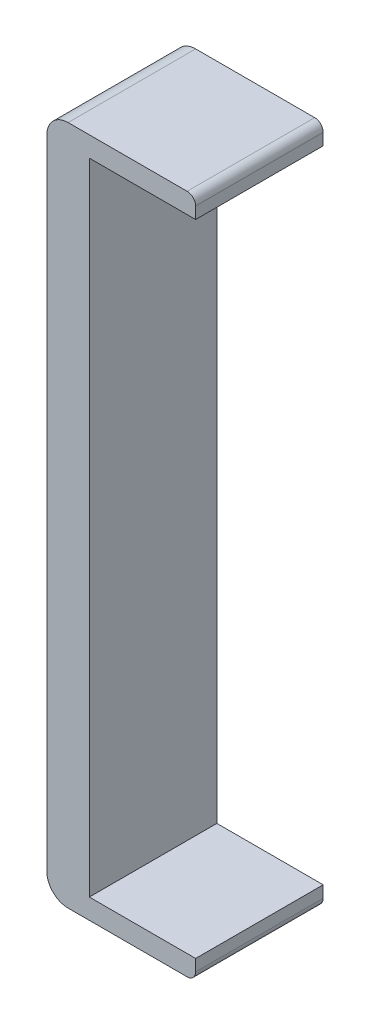
ISO-10303-21;
HEADER;
FILE_DESCRIPTION(('STEP AP214'),'2;1');
FILE_NAME('part.step','',(''),(''),'','','');
FILE_SCHEMA(('AUTOMOTIVE_DESIGN { 1 0 10303 214 1 1 1 1 }'));
ENDSEC;
DATA;
#1=APPLICATION_CONTEXT('core data for automotive mechanical design processes');
#2=APPLICATION_PROTOCOL_DEFINITION('international standard','automotive_design',2000,#1);
#3=PRODUCT_CONTEXT('',#1,'mechanical');
#4=PRODUCT('Part','Part','',(#3));
#5=PRODUCT_RELATED_PRODUCT_CATEGORY('part','',(#4));
#6=PRODUCT_DEFINITION_FORMATION('','',#4);
#7=PRODUCT_DEFINITION_CONTEXT('part definition',#1,'design');
#8=PRODUCT_DEFINITION('design','',#6,#7);
#9=PRODUCT_DEFINITION_SHAPE('','',#8);
#10=(LENGTH_UNIT() NAMED_UNIT(*) SI_UNIT(.MILLI.,.METRE.));
#11=(NAMED_UNIT(*) PLANE_ANGLE_UNIT() SI_UNIT($,.RADIAN.));
#12=(NAMED_UNIT(*) SI_UNIT($,.STERADIAN.) SOLID_ANGLE_UNIT());
#13=UNCERTAINTY_MEASURE_WITH_UNIT(LENGTH_MEASURE(1.E-05),#10,'distance_accuracy_value','');
#14=(GEOMETRIC_REPRESENTATION_CONTEXT(3) GLOBAL_UNCERTAINTY_ASSIGNED_CONTEXT((#13)) GLOBAL_UNIT_ASSIGNED_CONTEXT((#10,
#11,#12)) REPRESENTATION_CONTEXT('',''));
#15=CARTESIAN_POINT('',(0.,0.,0.));
#16=DIRECTION('',(0.,0.,1.));
#17=DIRECTION('',(1.,0.,0.));
#18=AXIS2_PLACEMENT_3D('',#15,#16,#17);
#19=CARTESIAN_POINT('',(-12.5,74.9998503349519,30.));
#20=DIRECTION('',(0.,0.,-1.));
#21=DIRECTION('',(-1.,0.,0.));
#22=AXIS2_PLACEMENT_3D('',#19,#20,#21);
#23=CYLINDRICAL_SURFACE('',#22,5.);
#24=CARTESIAN_POINT('',(-12.5,74.9998503349519,0.));
#25=DIRECTION('',(0.,0.,1.));
#26=DIRECTION('',(1.,0.,0.));
#27=AXIS2_PLACEMENT_3D('',#24,#25,#26);
#28=CIRCLE('',#27,5.);
#29=CARTESIAN_POINT('',(-12.5,79.9998503349519,0.));
#30=VERTEX_POINT('',#29);
#31=CARTESIAN_POINT('',(-17.5,74.9998503349519,0.));
#32=VERTEX_POINT('',#31);
#33=EDGE_CURVE('E153',#30,#32,#28,.T.);
#34=ORIENTED_EDGE('',*,*,#33,.T.);
#35=DIRECTION('',(0.,0.,-1.));
#36=VECTOR('',#35,1.);
#37=CARTESIAN_POINT('',(-17.5,74.9998503349519,30.));
#38=LINE('',#37,#36);
#39=CARTESIAN_POINT('',(-17.5,74.9998503349519,30.));
#40=VERTEX_POINT('',#39);
#41=EDGE_CURVE('E11',#40,#32,#38,.T.);
#42=ORIENTED_EDGE('',*,*,#41,.F.);
#43=CARTESIAN_POINT('',(-12.5,74.9998503349519,30.));
#44=DIRECTION('',(0.,0.,1.));
#45=DIRECTION('',(1.,0.,0.));
#46=AXIS2_PLACEMENT_3D('',#43,#44,#45);
#47=CIRCLE('',#46,5.);
#48=CARTESIAN_POINT('',(-12.5,79.9998503349519,30.));
#49=VERTEX_POINT('',#48);
#50=EDGE_CURVE('E175',#49,#40,#47,.T.);
#51=ORIENTED_EDGE('',*,*,#50,.F.);
#52=DIRECTION('',(0.,0.,-1.));
#53=VECTOR('',#52,1.);
#54=CARTESIAN_POINT('',(-12.5,79.9998503349519,30.));
#55=LINE('',#54,#53);
#56=EDGE_CURVE('E149',#49,#30,#55,.T.);
#57=ORIENTED_EDGE('',*,*,#56,.T.);
#58=EDGE_LOOP('',(#34,#42,#51,#57));
#59=FACE_BOUND('',#58,.T.);
#60=ADVANCED_FACE('F33',(#59),#23,.T.);
#61=CARTESIAN_POINT('',(-17.5,74.9998503349519,30.));
#62=DIRECTION('',(1.,0.,0.));
#63=DIRECTION('',(0.,0.,-1.));
#64=AXIS2_PLACEMENT_3D('',#61,#62,#63);
#65=PLANE('',#64);
#66=DIRECTION('',(0.,-1.,0.));
#67=VECTOR('',#66,1.);
#68=CARTESIAN_POINT('',(-17.5,74.9998503349519,0.));
#69=LINE('',#68,#67);
#70=CARTESIAN_POINT('',(-17.5,-74.9998503349519,0.));
#71=VERTEX_POINT('',#70);
#72=EDGE_CURVE('E156',#32,#71,#69,.T.);
#73=ORIENTED_EDGE('',*,*,#72,.T.);
#74=DIRECTION('',(0.,0.,-1.));
#75=VECTOR('',#74,1.);
#76=CARTESIAN_POINT('',(-17.5,-74.9998503349519,30.));
#77=LINE('',#76,#75);
#78=CARTESIAN_POINT('',(-17.5,-74.9998503349519,30.));
#79=VERTEX_POINT('',#78);
#80=EDGE_CURVE('E41',#79,#71,#77,.T.);
#81=ORIENTED_EDGE('',*,*,#80,.F.);
#82=DIRECTION('',(0.,-1.,0.));
#83=VECTOR('',#82,1.);
#84=CARTESIAN_POINT('',(-17.5,74.9998503349519,30.));
#85=LINE('',#84,#83);
#86=EDGE_CURVE('E104',#40,#79,#85,.T.);
#87=ORIENTED_EDGE('',*,*,#86,.F.);
#88=ORIENTED_EDGE('',*,*,#41,.T.);
#89=EDGE_LOOP('',(#73,#81,#87,#88));
#90=FACE_BOUND('',#89,.T.);
#91=ADVANCED_FACE('F253',(#90),#65,.F.);
#92=CARTESIAN_POINT('',(-12.5,-74.9998503349519,30.));
#93=DIRECTION('',(0.,0.,-1.));
#94=DIRECTION('',(-1.,0.,0.));
#95=AXIS2_PLACEMENT_3D('',#92,#93,#94);
#96=CYLINDRICAL_SURFACE('',#95,5.);
#97=CARTESIAN_POINT('',(-12.5,-74.9998503349519,0.));
#98=DIRECTION('',(0.,0.,1.));
#99=DIRECTION('',(1.,0.,0.));
#100=AXIS2_PLACEMENT_3D('',#97,#98,#99);
#101=CIRCLE('',#100,5.);
#102=CARTESIAN_POINT('',(-12.5,-79.9998503349519,0.));
#103=VERTEX_POINT('',#102);
#104=EDGE_CURVE('E158',#71,#103,#101,.T.);
#105=ORIENTED_EDGE('',*,*,#104,.T.);
#106=DIRECTION('',(0.,0.,-1.));
#107=VECTOR('',#106,1.);
#108=CARTESIAN_POINT('',(-12.5,-79.9998503349519,30.));
#109=LINE('',#108,#107);
#110=CARTESIAN_POINT('',(-12.5,-79.9998503349519,30.));
#111=VERTEX_POINT('',#110);
#112=EDGE_CURVE('E194',#111,#103,#109,.T.);
#113=ORIENTED_EDGE('',*,*,#112,.F.);
#114=CARTESIAN_POINT('',(-12.5,-74.9998503349519,30.));
#115=DIRECTION('',(0.,0.,1.));
#116=DIRECTION('',(1.,0.,0.));
#117=AXIS2_PLACEMENT_3D('',#114,#115,#116);
#118=CIRCLE('',#117,5.);
#119=EDGE_CURVE('E202',#79,#111,#118,.T.);
#120=ORIENTED_EDGE('',*,*,#119,.F.);
#121=ORIENTED_EDGE('',*,*,#80,.T.);
#122=EDGE_LOOP('',(#105,#113,#120,#121));
#123=FACE_BOUND('',#122,.T.);
#124=ADVANCED_FACE('F200',(#123),#96,.T.);
#125=CARTESIAN_POINT('',(-12.5,-79.9998503349519,30.));
#126=DIRECTION('',(0.,1.,0.));
#127=DIRECTION('',(0.,0.,1.));
#128=AXIS2_PLACEMENT_3D('',#125,#126,#127);
#129=PLANE('',#128);
#130=DIRECTION('',(1.,0.,0.));
#131=VECTOR('',#130,1.);
#132=CARTESIAN_POINT('',(-12.5,-79.9998503349519,0.));
#133=LINE('',#132,#131);
#134=CARTESIAN_POINT('',(15.5,-79.9998503349519,0.));
#135=VERTEX_POINT('',#134);
#136=EDGE_CURVE('E160',#103,#135,#133,.T.);
#137=ORIENTED_EDGE('',*,*,#136,.T.);
#138=DIRECTION('',(0.,0.,-1.));
#139=VECTOR('',#138,1.);
#140=CARTESIAN_POINT('',(15.5,-79.9998503349519,30.));
#141=LINE('',#140,#139);
#142=CARTESIAN_POINT('',(15.5,-79.9998503349519,30.));
#143=VERTEX_POINT('',#142);
#144=EDGE_CURVE('E191',#143,#135,#141,.T.);
#145=ORIENTED_EDGE('',*,*,#144,.F.);
#146=DIRECTION('',(1.,0.,0.));
#147=VECTOR('',#146,1.);
#148=CARTESIAN_POINT('',(-12.5,-79.9998503349519,30.));
#149=LINE('',#148,#147);
#150=EDGE_CURVE('E220',#111,#143,#149,.T.);
#151=ORIENTED_EDGE('',*,*,#150,.F.);
#152=ORIENTED_EDGE('',*,*,#112,.T.);
#153=EDGE_LOOP('',(#137,#145,#151,#152));
#154=FACE_BOUND('',#153,.T.);
#155=ADVANCED_FACE('F211',(#154),#129,.F.);
#156=CARTESIAN_POINT('',(15.5,-77.9998503349519,30.));
#157=DIRECTION('',(0.,0.,-1.));
#158=DIRECTION('',(-1.,0.,0.));
#159=AXIS2_PLACEMENT_3D('',#156,#157,#158);
#160=CYLINDRICAL_SURFACE('',#159,2.);
#161=CARTESIAN_POINT('',(15.5,-77.9998503349519,0.));
#162=DIRECTION('',(0.,0.,1.));
#163=DIRECTION('',(1.,0.,0.));
#164=AXIS2_PLACEMENT_3D('',#161,#162,#163);
#165=CIRCLE('',#164,2.);
#166=CARTESIAN_POINT('',(17.5,-77.9998503349519,0.));
#167=VERTEX_POINT('',#166);
#168=EDGE_CURVE('E162',#135,#167,#165,.T.);
#169=ORIENTED_EDGE('',*,*,#168,.T.);
#170=DIRECTION('',(0.,0.,-1.));
#171=VECTOR('',#170,1.);
#172=CARTESIAN_POINT('',(17.5,-77.9998503349519,30.));
#173=LINE('',#172,#171);
#174=CARTESIAN_POINT('',(17.5,-77.9998503349519,30.));
#175=VERTEX_POINT('',#174);
#176=EDGE_CURVE('E188',#175,#167,#173,.T.);
#177=ORIENTED_EDGE('',*,*,#176,.F.);
#178=CARTESIAN_POINT('',(15.5,-77.9998503349519,30.));
#179=DIRECTION('',(0.,0.,1.));
#180=DIRECTION('',(1.,0.,0.));
#181=AXIS2_PLACEMENT_3D('',#178,#179,#180);
#182=CIRCLE('',#181,2.);
#183=EDGE_CURVE('E217',#143,#175,#182,.T.);
#184=ORIENTED_EDGE('',*,*,#183,.F.);
#185=ORIENTED_EDGE('',*,*,#144,.T.);
#186=EDGE_LOOP('',(#169,#177,#184,#185));
#187=FACE_BOUND('',#186,.T.);
#188=ADVANCED_FACE('F215',(#187),#160,.T.);
#189=CARTESIAN_POINT('',(17.5,-77.9998503349519,30.));
#190=DIRECTION('',(-1.,0.,0.));
#191=DIRECTION('',(0.,0.,1.));
#192=AXIS2_PLACEMENT_3D('',#189,#190,#191);
#193=PLANE('',#192);
#194=DIRECTION('',(0.,1.,0.));
#195=VECTOR('',#194,1.);
#196=CARTESIAN_POINT('',(17.5,-77.9998503349519,0.));
#197=LINE('',#196,#195);
#198=CARTESIAN_POINT('',(17.5,-75.2498503349519,0.));
#199=VERTEX_POINT('',#198);
#200=EDGE_CURVE('E164',#167,#199,#197,.T.);
#201=ORIENTED_EDGE('',*,*,#200,.T.);
#202=DIRECTION('',(0.,0.,-1.));
#203=VECTOR('',#202,1.);
#204=CARTESIAN_POINT('',(17.5,-75.2498503349519,30.));
#205=LINE('',#204,#203);
#206=CARTESIAN_POINT('',(17.5,-75.2498503349519,30.));
#207=VERTEX_POINT('',#206);
#208=EDGE_CURVE('E185',#207,#199,#205,.T.);
#209=ORIENTED_EDGE('',*,*,#208,.F.);
#210=DIRECTION('',(0.,1.,0.));
#211=VECTOR('',#210,1.);
#212=CARTESIAN_POINT('',(17.5,-77.9998503349519,30.));
#213=LINE('',#212,#211);
#214=EDGE_CURVE('E219',#175,#207,#213,.T.);
#215=ORIENTED_EDGE('',*,*,#214,.F.);
#216=ORIENTED_EDGE('',*,*,#176,.T.);
#217=EDGE_LOOP('',(#201,#209,#215,#216));
#218=FACE_BOUND('',#217,.T.);
#219=ADVANCED_FACE('F266',(#218),#193,.F.);
#220=CARTESIAN_POINT('',(17.5,-75.2498503349519,30.));
#221=DIRECTION('',(0.,-1.,0.));
#222=DIRECTION('',(0.,0.,-1.));
#223=AXIS2_PLACEMENT_3D('',#220,#221,#222);
#224=PLANE('',#223);
#225=DIRECTION('',(-1.,0.,0.));
#226=VECTOR('',#225,1.);
#227=CARTESIAN_POINT('',(17.5,-75.2498503349519,0.));
#228=LINE('',#227,#226);
#229=CARTESIAN_POINT('',(-7.49999999999995,-75.2498503349519,0.));
#230=VERTEX_POINT('',#229);
#231=EDGE_CURVE('E166',#199,#230,#228,.T.);
#232=ORIENTED_EDGE('',*,*,#231,.T.);
#233=DIRECTION('',(0.,0.,-1.));
#234=VECTOR('',#233,1.);
#235=CARTESIAN_POINT('',(-7.49999999999995,-75.2498503349519,30.));
#236=LINE('',#235,#234);
#237=CARTESIAN_POINT('',(-7.49999999999995,-75.2498503349519,30.));
#238=VERTEX_POINT('',#237);
#239=EDGE_CURVE('E182',#238,#230,#236,.T.);
#240=ORIENTED_EDGE('',*,*,#239,.F.);
#241=DIRECTION('',(-1.,0.,0.));
#242=VECTOR('',#241,1.);
#243=CARTESIAN_POINT('',(17.5,-75.2498503349519,30.));
#244=LINE('',#243,#242);
#245=EDGE_CURVE('E222',#207,#238,#244,.T.);
#246=ORIENTED_EDGE('',*,*,#245,.F.);
#247=ORIENTED_EDGE('',*,*,#208,.T.);
#248=EDGE_LOOP('',(#232,#240,#246,#247));
#249=FACE_BOUND('',#248,.T.);
#250=ADVANCED_FACE('F269',(#249),#224,.F.);
#251=CARTESIAN_POINT('',(-7.49999999999995,-75.2498503349519,30.));
#252=DIRECTION('',(-1.,0.,0.));
#253=DIRECTION('',(0.,0.,1.));
#254=AXIS2_PLACEMENT_3D('',#251,#252,#253);
#255=PLANE('',#254);
#256=DIRECTION('',(0.,1.,0.));
#257=VECTOR('',#256,1.);
#258=CARTESIAN_POINT('',(-7.49999999999995,-75.2498503349519,0.));
#259=LINE('',#258,#257);
#260=CARTESIAN_POINT('',(-7.49999999999995,75.2501496650481,0.));
#261=VERTEX_POINT('',#260);
#262=EDGE_CURVE('E168',#230,#261,#259,.T.);
#263=ORIENTED_EDGE('',*,*,#262,.T.);
#264=DIRECTION('',(0.,0.,-1.));
#265=VECTOR('',#264,1.);
#266=CARTESIAN_POINT('',(-7.49999999999995,75.2501496650481,30.));
#267=LINE('',#266,#265);
#268=CARTESIAN_POINT('',(-7.49999999999995,75.2501496650481,30.));
#269=VERTEX_POINT('',#268);
#270=EDGE_CURVE('E179',#269,#261,#267,.T.);
#271=ORIENTED_EDGE('',*,*,#270,.F.);
#272=DIRECTION('',(0.,1.,0.));
#273=VECTOR('',#272,1.);
#274=CARTESIAN_POINT('',(-7.49999999999995,-75.2498503349519,30.));
#275=LINE('',#274,#273);
#276=EDGE_CURVE('E228',#238,#269,#275,.T.);
#277=ORIENTED_EDGE('',*,*,#276,.F.);
#278=ORIENTED_EDGE('',*,*,#239,.T.);
#279=EDGE_LOOP('',(#263,#271,#277,#278));
#280=FACE_BOUND('',#279,.T.);
#281=ADVANCED_FACE('F234',(#280),#255,.F.);
#282=CARTESIAN_POINT('',(-7.49999999999995,75.2501496650481,30.));
#283=DIRECTION('',(0.,1.,0.));
#284=DIRECTION('',(0.,0.,1.));
#285=AXIS2_PLACEMENT_3D('',#282,#283,#284);
#286=PLANE('',#285);
#287=DIRECTION('',(1.,0.,0.));
#288=VECTOR('',#287,1.);
#289=CARTESIAN_POINT('',(-7.49999999999995,75.2501496650481,0.));
#290=LINE('',#289,#288);
#291=CARTESIAN_POINT('',(17.5,75.2501496650481,0.));
#292=VERTEX_POINT('',#291);
#293=EDGE_CURVE('E170',#261,#292,#290,.T.);
#294=ORIENTED_EDGE('',*,*,#293,.T.);
#295=DIRECTION('',(0.,0.,-1.));
#296=VECTOR('',#295,1.);
#297=CARTESIAN_POINT('',(17.5,75.2501496650481,30.));
#298=LINE('',#297,#296);
#299=CARTESIAN_POINT('',(17.5,75.2501496650481,30.));
#300=VERTEX_POINT('',#299);
#301=EDGE_CURVE('E144',#300,#292,#298,.T.);
#302=ORIENTED_EDGE('',*,*,#301,.F.);
#303=DIRECTION('',(1.,0.,0.));
#304=VECTOR('',#303,1.);
#305=CARTESIAN_POINT('',(-7.49999999999995,75.2501496650481,30.));
#306=LINE('',#305,#304);
#307=EDGE_CURVE('E135',#269,#300,#306,.T.);
#308=ORIENTED_EDGE('',*,*,#307,.F.);
#309=ORIENTED_EDGE('',*,*,#270,.T.);
#310=EDGE_LOOP('',(#294,#302,#308,#309));
#311=FACE_BOUND('',#310,.T.);
#312=ADVANCED_FACE('F238',(#311),#286,.F.);
#313=CARTESIAN_POINT('',(17.5,75.2501496650481,30.));
#314=DIRECTION('',(-1.,0.,0.));
#315=DIRECTION('',(0.,0.,1.));
#316=AXIS2_PLACEMENT_3D('',#313,#314,#315);
#317=PLANE('',#316);
#318=DIRECTION('',(0.,1.,0.));
#319=VECTOR('',#318,1.);
#320=CARTESIAN_POINT('',(17.5,75.2501496650481,0.));
#321=LINE('',#320,#319);
#322=CARTESIAN_POINT('',(17.5,77.9998503349519,0.));
#323=VERTEX_POINT('',#322);
#324=EDGE_CURVE('E143',#292,#323,#321,.T.);
#325=ORIENTED_EDGE('',*,*,#324,.T.);
#326=DIRECTION('',(0.,0.,-1.));
#327=VECTOR('',#326,1.);
#328=CARTESIAN_POINT('',(17.5,77.9998503349519,30.));
#329=LINE('',#328,#327);
#330=CARTESIAN_POINT('',(17.5,77.9998503349519,30.));
#331=VERTEX_POINT('',#330);
#332=EDGE_CURVE('E140',#331,#323,#329,.T.);
#333=ORIENTED_EDGE('',*,*,#332,.F.);
#334=DIRECTION('',(0.,1.,0.));
#335=VECTOR('',#334,1.);
#336=CARTESIAN_POINT('',(17.5,75.2501496650481,30.));
#337=LINE('',#336,#335);
#338=EDGE_CURVE('E129',#300,#331,#337,.T.);
#339=ORIENTED_EDGE('',*,*,#338,.F.);
#340=ORIENTED_EDGE('',*,*,#301,.T.);
#341=EDGE_LOOP('',(#325,#333,#339,#340));
#342=FACE_BOUND('',#341,.T.);
#343=ADVANCED_FACE('F141',(#342),#317,.F.);
#344=CARTESIAN_POINT('',(15.5,77.9998503349519,30.));
#345=DIRECTION('',(0.,0.,-1.));
#346=DIRECTION('',(-1.,0.,0.));
#347=AXIS2_PLACEMENT_3D('',#344,#345,#346);
#348=CYLINDRICAL_SURFACE('',#347,2.);
#349=CARTESIAN_POINT('',(15.5,77.9998503349519,0.));
#350=DIRECTION('',(0.,0.,1.));
#351=DIRECTION('',(1.,0.,0.));
#352=AXIS2_PLACEMENT_3D('',#349,#350,#351);
#353=CIRCLE('',#352,2.);
#354=CARTESIAN_POINT('',(15.5,79.9998503349519,0.));
#355=VERTEX_POINT('',#354);
#356=EDGE_CURVE('E90',#323,#355,#353,.T.);
#357=ORIENTED_EDGE('',*,*,#356,.T.);
#358=DIRECTION('',(0.,0.,-1.));
#359=VECTOR('',#358,1.);
#360=CARTESIAN_POINT('',(15.5,79.9998503349519,30.));
#361=LINE('',#360,#359);
#362=CARTESIAN_POINT('',(15.5,79.9998503349519,30.));
#363=VERTEX_POINT('',#362);
#364=EDGE_CURVE('E145',#363,#355,#361,.T.);
#365=ORIENTED_EDGE('',*,*,#364,.F.);
#366=CARTESIAN_POINT('',(15.5,77.9998503349519,30.));
#367=DIRECTION('',(0.,0.,1.));
#368=DIRECTION('',(1.,0.,0.));
#369=AXIS2_PLACEMENT_3D('',#366,#367,#368);
#370=CIRCLE('',#369,2.);
#371=EDGE_CURVE('E133',#331,#363,#370,.T.);
#372=ORIENTED_EDGE('',*,*,#371,.F.);
#373=ORIENTED_EDGE('',*,*,#332,.T.);
#374=EDGE_LOOP('',(#357,#365,#372,#373));
#375=FACE_BOUND('',#374,.T.);
#376=ADVANCED_FACE('F147',(#375),#348,.T.);
#377=CARTESIAN_POINT('',(15.5,79.9998503349519,30.));
#378=DIRECTION('',(0.,-1.,0.));
#379=DIRECTION('',(0.,0.,-1.));
#380=AXIS2_PLACEMENT_3D('',#377,#378,#379);
#381=PLANE('',#380);
#382=DIRECTION('',(-1.,0.,0.));
#383=VECTOR('',#382,1.);
#384=CARTESIAN_POINT('',(15.5,79.9998503349519,0.));
#385=LINE('',#384,#383);
#386=EDGE_CURVE('E96',#355,#30,#385,.T.);
#387=ORIENTED_EDGE('',*,*,#386,.T.);
#388=ORIENTED_EDGE('',*,*,#56,.F.);
#389=DIRECTION('',(-1.,0.,0.));
#390=VECTOR('',#389,1.);
#391=CARTESIAN_POINT('',(15.5,79.9998503349519,30.));
#392=LINE('',#391,#390);
#393=EDGE_CURVE('E49',#363,#49,#392,.T.);
#394=ORIENTED_EDGE('',*,*,#393,.F.);
#395=ORIENTED_EDGE('',*,*,#364,.T.);
#396=EDGE_LOOP('',(#387,#388,#394,#395));
#397=FACE_BOUND('',#396,.T.);
#398=ADVANCED_FACE('F242',(#397),#381,.F.);
#399=CARTESIAN_POINT('',(-12.5,74.9998503349519,30.));
#400=DIRECTION('',(0.,0.,1.));
#401=DIRECTION('',(1.,0.,0.));
#402=AXIS2_PLACEMENT_3D('',#399,#400,#401);
#403=PLANE('',#402);
#404=ORIENTED_EDGE('',*,*,#50,.T.);
#405=ORIENTED_EDGE('',*,*,#86,.T.);
#406=ORIENTED_EDGE('',*,*,#119,.T.);
#407=ORIENTED_EDGE('',*,*,#150,.T.);
#408=ORIENTED_EDGE('',*,*,#183,.T.);
#409=ORIENTED_EDGE('',*,*,#214,.T.);
#410=ORIENTED_EDGE('',*,*,#245,.T.);
#411=ORIENTED_EDGE('',*,*,#276,.T.);
#412=ORIENTED_EDGE('',*,*,#307,.T.);
#413=ORIENTED_EDGE('',*,*,#338,.T.);
#414=ORIENTED_EDGE('',*,*,#371,.T.);
#415=ORIENTED_EDGE('',*,*,#393,.T.);
#416=EDGE_LOOP('',(#404,#405,#406,#407,#408,#409,#410,#411,#412,#413,#414,#415));
#417=FACE_BOUND('',#416,.T.);
#418=ADVANCED_FACE('F131',(#417),#403,.T.);
#419=CARTESIAN_POINT('',(-12.5,74.9998503349519,0.));
#420=DIRECTION('',(0.,0.,1.));
#421=DIRECTION('',(1.,0.,0.));
#422=AXIS2_PLACEMENT_3D('',#419,#420,#421);
#423=PLANE('',#422);
#424=ORIENTED_EDGE('',*,*,#33,.F.);
#425=ORIENTED_EDGE('',*,*,#386,.F.);
#426=ORIENTED_EDGE('',*,*,#356,.F.);
#427=ORIENTED_EDGE('',*,*,#324,.F.);
#428=ORIENTED_EDGE('',*,*,#293,.F.);
#429=ORIENTED_EDGE('',*,*,#262,.F.);
#430=ORIENTED_EDGE('',*,*,#231,.F.);
#431=ORIENTED_EDGE('',*,*,#200,.F.);
#432=ORIENTED_EDGE('',*,*,#168,.F.);
#433=ORIENTED_EDGE('',*,*,#136,.F.);
#434=ORIENTED_EDGE('',*,*,#104,.F.);
#435=ORIENTED_EDGE('',*,*,#72,.F.);
#436=EDGE_LOOP('',(#424,#425,#426,#427,#428,#429,#430,#431,#432,#433,#434,#435));
#437=FACE_BOUND('',#436,.T.);
#438=ADVANCED_FACE('F206',(#437),#423,.F.);
#439=CLOSED_SHELL('',(#60,#91,#124,#155,#188,#219,#250,#281,#312,#343,#376,#398,#418,#438));
#440=MANIFOLD_SOLID_BREP('B2',#439);
#441=ADVANCED_BREP_SHAPE_REPRESENTATION('',(#18,#440),#14);
#442=SHAPE_DEFINITION_REPRESENTATION(#9,#441);
ENDSEC;
END-ISO-10303-21;
